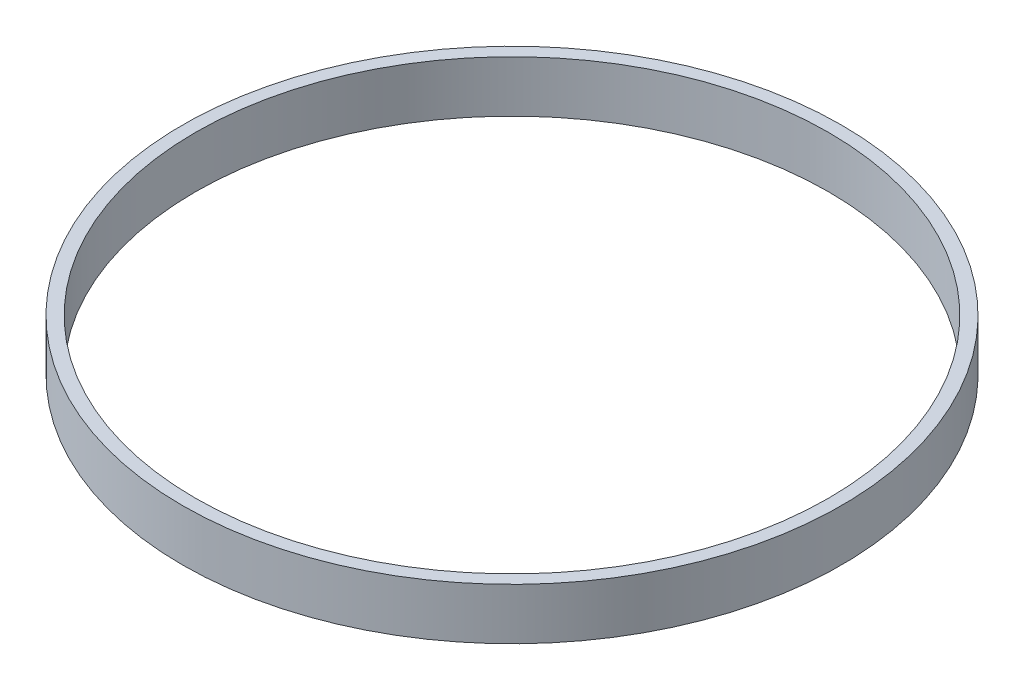
ISO-10303-21;
HEADER;
FILE_DESCRIPTION(('STEP AP214'),'2;1');
FILE_NAME('part.step','',(''),(''),'','','');
FILE_SCHEMA(('AUTOMOTIVE_DESIGN { 1 0 10303 214 1 1 1 1 }'));
ENDSEC;
DATA;
#1=APPLICATION_CONTEXT('core data for automotive mechanical design processes');
#2=APPLICATION_PROTOCOL_DEFINITION('international standard','automotive_design',2000,#1);
#3=PRODUCT_CONTEXT('',#1,'mechanical');
#4=PRODUCT('Part','Part','',(#3));
#5=PRODUCT_RELATED_PRODUCT_CATEGORY('part','',(#4));
#6=PRODUCT_DEFINITION_FORMATION('','',#4);
#7=PRODUCT_DEFINITION_CONTEXT('part definition',#1,'design');
#8=PRODUCT_DEFINITION('design','',#6,#7);
#9=PRODUCT_DEFINITION_SHAPE('','',#8);
#10=(LENGTH_UNIT() NAMED_UNIT(*) SI_UNIT(.MILLI.,.METRE.));
#11=(NAMED_UNIT(*) PLANE_ANGLE_UNIT() SI_UNIT($,.RADIAN.));
#12=(NAMED_UNIT(*) SI_UNIT($,.STERADIAN.) SOLID_ANGLE_UNIT());
#13=UNCERTAINTY_MEASURE_WITH_UNIT(LENGTH_MEASURE(1.E-05),#10,'distance_accuracy_value','');
#14=(GEOMETRIC_REPRESENTATION_CONTEXT(3) GLOBAL_UNCERTAINTY_ASSIGNED_CONTEXT((#13)) GLOBAL_UNIT_ASSIGNED_CONTEXT((#10,
#11,#12)) REPRESENTATION_CONTEXT('',''));
#15=CARTESIAN_POINT('',(0.,0.,0.));
#16=DIRECTION('',(0.,0.,1.));
#17=DIRECTION('',(1.,0.,0.));
#18=AXIS2_PLACEMENT_3D('',#15,#16,#17);
#19=CARTESIAN_POINT('',(0.,12.7,0.));
#20=DIRECTION('',(0.,1.,0.));
#21=DIRECTION('',(0.,0.,1.));
#22=AXIS2_PLACEMENT_3D('',#19,#20,#21);
#23=PLANE('',#22);
#24=CARTESIAN_POINT('',(0.,12.7,0.));
#25=DIRECTION('',(0.,1.,0.));
#26=DIRECTION('',(0.,0.,1.));
#27=AXIS2_PLACEMENT_3D('',#24,#25,#26);
#28=CIRCLE('',#27,81.3308);
#29=CARTESIAN_POINT('',(0.,12.7,81.3308));
#30=VERTEX_POINT('',#29);
#31=EDGE_CURVE('E10',#30,#30,#28,.T.);
#32=ORIENTED_EDGE('',*,*,#31,.T.);
#33=EDGE_LOOP('',(#32));
#34=FACE_BOUND('',#33,.T.);
#35=CARTESIAN_POINT('',(0.,12.7,0.));
#36=DIRECTION('',(0.,1.,0.));
#37=DIRECTION('',(0.,0.,1.));
#38=AXIS2_PLACEMENT_3D('',#35,#36,#37);
#39=CIRCLE('',#38,78.1558);
#40=CARTESIAN_POINT('',(0.,12.7,78.1558));
#41=VERTEX_POINT('',#40);
#42=EDGE_CURVE('E48',#41,#41,#39,.T.);
#43=ORIENTED_EDGE('',*,*,#42,.F.);
#44=EDGE_LOOP('',(#43));
#45=FACE_BOUND('',#44,.T.);
#46=ADVANCED_FACE('F37',(#34,#45),#23,.T.);
#47=CARTESIAN_POINT('',(0.,0.,0.));
#48=DIRECTION('',(0.,1.,0.));
#49=DIRECTION('',(0.,0.,1.));
#50=AXIS2_PLACEMENT_3D('',#47,#48,#49);
#51=PLANE('',#50);
#52=CARTESIAN_POINT('',(0.,0.,0.));
#53=DIRECTION('',(0.,1.,0.));
#54=DIRECTION('',(0.,0.,1.));
#55=AXIS2_PLACEMENT_3D('',#52,#53,#54);
#56=CIRCLE('',#55,81.3308);
#57=CARTESIAN_POINT('',(0.,0.,81.3308));
#58=VERTEX_POINT('',#57);
#59=EDGE_CURVE('E41',#58,#58,#56,.T.);
#60=ORIENTED_EDGE('',*,*,#59,.F.);
#61=EDGE_LOOP('',(#60));
#62=FACE_BOUND('',#61,.T.);
#63=CARTESIAN_POINT('',(0.,0.,0.));
#64=DIRECTION('',(0.,1.,0.));
#65=DIRECTION('',(0.,0.,1.));
#66=AXIS2_PLACEMENT_3D('',#63,#64,#65);
#67=CIRCLE('',#66,78.1558);
#68=CARTESIAN_POINT('',(0.,0.,78.1558));
#69=VERTEX_POINT('',#68);
#70=EDGE_CURVE('E50',#69,#69,#67,.T.);
#71=ORIENTED_EDGE('',*,*,#70,.T.);
#72=EDGE_LOOP('',(#71));
#73=FACE_BOUND('',#72,.T.);
#74=ADVANCED_FACE('F60',(#62,#73),#51,.F.);
#75=CARTESIAN_POINT('',(0.,12.7,0.));
#76=DIRECTION('',(0.,-1.,0.));
#77=DIRECTION('',(0.,0.,-1.));
#78=AXIS2_PLACEMENT_3D('',#75,#76,#77);
#79=CYLINDRICAL_SURFACE('',#78,81.3308);
#80=ORIENTED_EDGE('',*,*,#31,.F.);
#81=EDGE_LOOP('',(#80));
#82=FACE_BOUND('',#81,.T.);
#83=ORIENTED_EDGE('',*,*,#59,.T.);
#84=EDGE_LOOP('',(#83));
#85=FACE_BOUND('',#84,.T.);
#86=ADVANCED_FACE('F39',(#82,#85),#79,.T.);
#87=CARTESIAN_POINT('',(0.,12.7,0.));
#88=DIRECTION('',(0.,-1.,0.));
#89=DIRECTION('',(0.,0.,-1.));
#90=AXIS2_PLACEMENT_3D('',#87,#88,#89);
#91=CYLINDRICAL_SURFACE('',#90,78.1558);
#92=ORIENTED_EDGE('',*,*,#42,.T.);
#93=EDGE_LOOP('',(#92));
#94=FACE_BOUND('',#93,.T.);
#95=ORIENTED_EDGE('',*,*,#70,.F.);
#96=EDGE_LOOP('',(#95));
#97=FACE_BOUND('',#96,.T.);
#98=ADVANCED_FACE('F56',(#94,#97),#91,.F.);
#99=CLOSED_SHELL('',(#46,#74,#86,#98));
#100=MANIFOLD_SOLID_BREP('B2',#99);
#101=ADVANCED_BREP_SHAPE_REPRESENTATION('',(#18,#100),#14);
#102=SHAPE_DEFINITION_REPRESENTATION(#9,#101);
ENDSEC;
END-ISO-10303-21;
